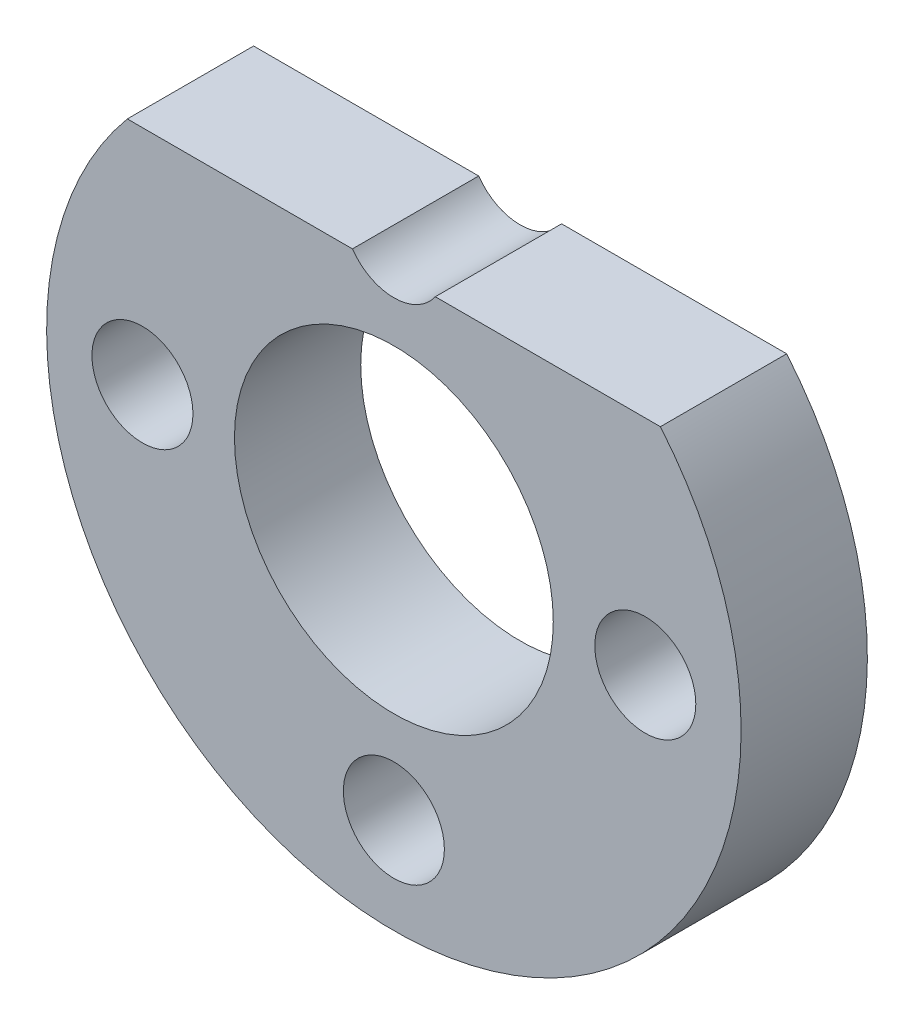
ISO-10303-21;
HEADER;
FILE_DESCRIPTION(('STEP AP214'),'2;1');
FILE_NAME('part.step','',(''),(''),'','','');
FILE_SCHEMA(('AUTOMOTIVE_DESIGN { 1 0 10303 214 1 1 1 1 }'));
ENDSEC;
DATA;
#1=APPLICATION_CONTEXT('core data for automotive mechanical design processes');
#2=APPLICATION_PROTOCOL_DEFINITION('international standard','automotive_design',2000,#1);
#3=PRODUCT_CONTEXT('',#1,'mechanical');
#4=PRODUCT('Part','Part','',(#3));
#5=PRODUCT_RELATED_PRODUCT_CATEGORY('part','',(#4));
#6=PRODUCT_DEFINITION_FORMATION('','',#4);
#7=PRODUCT_DEFINITION_CONTEXT('part definition',#1,'design');
#8=PRODUCT_DEFINITION('design','',#6,#7);
#9=PRODUCT_DEFINITION_SHAPE('','',#8);
#10=(LENGTH_UNIT() NAMED_UNIT(*) SI_UNIT(.MILLI.,.METRE.));
#11=(NAMED_UNIT(*) PLANE_ANGLE_UNIT() SI_UNIT($,.RADIAN.));
#12=(NAMED_UNIT(*) SI_UNIT($,.STERADIAN.) SOLID_ANGLE_UNIT());
#13=UNCERTAINTY_MEASURE_WITH_UNIT(LENGTH_MEASURE(1.E-05),#10,'distance_accuracy_value','');
#14=(GEOMETRIC_REPRESENTATION_CONTEXT(3) GLOBAL_UNCERTAINTY_ASSIGNED_CONTEXT((#13)) GLOBAL_UNIT_ASSIGNED_CONTEXT((#10,
#11,#12)) REPRESENTATION_CONTEXT('',''));
#15=CARTESIAN_POINT('',(0.,0.,0.));
#16=DIRECTION('',(0.,0.,1.));
#17=DIRECTION('',(1.,0.,0.));
#18=AXIS2_PLACEMENT_3D('',#15,#16,#17);
#19=CARTESIAN_POINT('',(95.2028085271053,-295.7159331995,4.));
#20=DIRECTION('',(0.,-1.,0.));
#21=DIRECTION('',(0.,0.,-1.));
#22=AXIS2_PLACEMENT_3D('',#19,#20,#21);
#23=PLANE('',#22);
#24=DIRECTION('',(-1.,0.,0.));
#25=VECTOR('',#24,1.);
#26=CARTESIAN_POINT('',(95.2028085271053,-295.7159331995,0.));
#27=LINE('',#26,#25);
#28=CARTESIAN_POINT('',(112.090377920005,-295.7159331995,0.));
#29=VERTEX_POINT('',#28);
#30=CARTESIAN_POINT('',(104.95933145547,-295.7159331995,0.));
#31=VERTEX_POINT('',#30);
#32=EDGE_CURVE('E77',#29,#31,#27,.T.);
#33=ORIENTED_EDGE('',*,*,#32,.T.);
#34=DIRECTION('',(0.,0.,1.));
#35=VECTOR('',#34,1.);
#36=CARTESIAN_POINT('',(104.95933145547,-295.7159331995,4.));
#37=LINE('',#36,#35);
#38=CARTESIAN_POINT('',(104.95933145547,-295.7159331995,4.));
#39=VERTEX_POINT('',#38);
#40=EDGE_CURVE('E11',#31,#39,#37,.T.);
#41=ORIENTED_EDGE('',*,*,#40,.T.);
#42=DIRECTION('',(-1.,0.,0.));
#43=VECTOR('',#42,1.);
#44=CARTESIAN_POINT('',(95.2028085271053,-295.7159331995,4.));
#45=LINE('',#44,#43);
#46=CARTESIAN_POINT('',(112.090377920005,-295.7159331995,4.));
#47=VERTEX_POINT('',#46);
#48=EDGE_CURVE('E85',#47,#39,#45,.T.);
#49=ORIENTED_EDGE('',*,*,#48,.F.);
#50=DIRECTION('',(0.,0.,-1.));
#51=VECTOR('',#50,1.);
#52=CARTESIAN_POINT('',(112.090377920005,-295.7159331995,4.));
#53=LINE('',#52,#51);
#54=EDGE_CURVE('E84',#47,#29,#53,.T.);
#55=ORIENTED_EDGE('',*,*,#54,.T.);
#56=EDGE_LOOP('',(#33,#41,#49,#55));
#57=FACE_BOUND('',#56,.T.);
#58=ADVANCED_FACE('F32',(#57),#23,.F.);
#59=CARTESIAN_POINT('',(103.646593223555,-302.7659331995,4.));
#60=DIRECTION('',(0.,0.,-1.));
#61=DIRECTION('',(-1.,0.,0.));
#62=AXIS2_PLACEMENT_3D('',#59,#60,#61);
#63=CYLINDRICAL_SURFACE('',#62,11.);
#64=CARTESIAN_POINT('',(103.646593223555,-302.7659331995,0.));
#65=DIRECTION('',(0.,0.,1.));
#66=DIRECTION('',(1.,0.,0.));
#67=AXIS2_PLACEMENT_3D('',#64,#65,#66);
#68=CIRCLE('',#67,11.);
#69=CARTESIAN_POINT('',(95.2028085271053,-295.7159331995,0.));
#70=VERTEX_POINT('',#69);
#71=EDGE_CURVE('E78',#70,#29,#68,.T.);
#72=ORIENTED_EDGE('',*,*,#71,.T.);
#73=ORIENTED_EDGE('',*,*,#54,.F.);
#74=CARTESIAN_POINT('',(103.646593223555,-302.7659331995,4.));
#75=DIRECTION('',(0.,0.,1.));
#76=DIRECTION('',(1.,0.,0.));
#77=AXIS2_PLACEMENT_3D('',#74,#75,#76);
#78=CIRCLE('',#77,11.);
#79=CARTESIAN_POINT('',(95.2028085271053,-295.7159331995,4.));
#80=VERTEX_POINT('',#79);
#81=EDGE_CURVE('E83',#80,#47,#78,.T.);
#82=ORIENTED_EDGE('',*,*,#81,.F.);
#83=DIRECTION('',(0.,0.,-1.));
#84=VECTOR('',#83,1.);
#85=CARTESIAN_POINT('',(95.2028085271053,-295.7159331995,4.));
#86=LINE('',#85,#84);
#87=EDGE_CURVE('E71',#80,#70,#86,.T.);
#88=ORIENTED_EDGE('',*,*,#87,.T.);
#89=EDGE_LOOP('',(#72,#73,#82,#88));
#90=FACE_BOUND('',#89,.T.);
#91=ADVANCED_FACE('F34',(#90),#63,.T.);
#92=CARTESIAN_POINT('',(102.333854991646,-295.7159331995,4.));
#93=VERTEX_POINT('',#92);
#94=EDGE_CURVE('E54',#93,#80,#45,.T.);
#95=ORIENTED_EDGE('',*,*,#94,.F.);
#96=DIRECTION('',(0.,0.,1.));
#97=VECTOR('',#96,1.);
#98=CARTESIAN_POINT('',(102.333854991646,-295.7159331995,4.));
#99=LINE('',#98,#97);
#100=CARTESIAN_POINT('',(102.333854991646,-295.7159331995,0.));
#101=VERTEX_POINT('',#100);
#102=EDGE_CURVE('E40',#93,#101,#99,.F.);
#103=ORIENTED_EDGE('',*,*,#102,.T.);
#104=EDGE_CURVE('E68',#101,#70,#27,.T.);
#105=ORIENTED_EDGE('',*,*,#104,.T.);
#106=ORIENTED_EDGE('',*,*,#87,.F.);
#107=EDGE_LOOP('',(#95,#103,#105,#106));
#108=FACE_BOUND('',#107,.T.);
#109=ADVANCED_FACE('F70',(#108),#23,.F.);
#110=CARTESIAN_POINT('',(103.646593223555,-302.7659331995,4.));
#111=DIRECTION('',(0.,0.,1.));
#112=DIRECTION('',(1.,0.,0.));
#113=AXIS2_PLACEMENT_3D('',#110,#111,#112);
#114=PLANE('',#113);
#115=CARTESIAN_POINT('',(95.6818701318656,-302.765933199499,4.));
#116=DIRECTION('',(0.,0.,1.));
#117=DIRECTION('',(1.,0.,0.));
#118=AXIS2_PLACEMENT_3D('',#115,#116,#117);
#119=CIRCLE('',#118,1.59999999999999);
#120=CARTESIAN_POINT('',(97.2818701318656,-302.765933199499,4.));
#121=VERTEX_POINT('',#120);
#122=EDGE_CURVE('E124',#121,#121,#119,.T.);
#123=ORIENTED_EDGE('',*,*,#122,.F.);
#124=EDGE_LOOP('',(#123));
#125=FACE_BOUND('',#124,.T.);
#126=CARTESIAN_POINT('',(111.61131631525,-302.765933199499,4.));
#127=DIRECTION('',(0.,0.,1.));
#128=DIRECTION('',(1.,0.,0.));
#129=AXIS2_PLACEMENT_3D('',#126,#127,#128);
#130=CIRCLE('',#129,1.59999999999999);
#131=CARTESIAN_POINT('',(113.21131631525,-302.765933199499,4.));
#132=VERTEX_POINT('',#131);
#133=EDGE_CURVE('E118',#132,#132,#130,.T.);
#134=ORIENTED_EDGE('',*,*,#133,.F.);
#135=EDGE_LOOP('',(#134));
#136=FACE_BOUND('',#135,.T.);
#137=CARTESIAN_POINT('',(103.646593223558,-310.730656291191,4.));
#138=DIRECTION('',(0.,0.,1.));
#139=DIRECTION('',(1.,0.,0.));
#140=AXIS2_PLACEMENT_3D('',#137,#138,#139);
#141=CIRCLE('',#140,1.59999999999999);
#142=CARTESIAN_POINT('',(105.246593223558,-310.730656291191,4.));
#143=VERTEX_POINT('',#142);
#144=EDGE_CURVE('E112',#143,#143,#141,.T.);
#145=ORIENTED_EDGE('',*,*,#144,.F.);
#146=EDGE_LOOP('',(#145));
#147=FACE_BOUND('',#146,.T.);
#148=CARTESIAN_POINT('',(103.646593223558,-294.801210107807,4.));
#149=DIRECTION('',(0.,0.,1.));
#150=DIRECTION('',(1.,0.,0.));
#151=AXIS2_PLACEMENT_3D('',#148,#149,#150);
#152=CIRCLE('',#151,1.59999999999999);
#153=EDGE_CURVE('E107',#93,#39,#152,.T.);
#154=ORIENTED_EDGE('',*,*,#153,.F.);
#155=ORIENTED_EDGE('',*,*,#94,.T.);
#156=ORIENTED_EDGE('',*,*,#81,.T.);
#157=ORIENTED_EDGE('',*,*,#48,.T.);
#158=EDGE_LOOP('',(#154,#155,#156,#157));
#159=FACE_BOUND('',#158,.T.);
#160=CARTESIAN_POINT('',(103.646593223555,-302.7659331995,4.));
#161=DIRECTION('',(0.,0.,1.));
#162=DIRECTION('',(1.,0.,0.));
#163=AXIS2_PLACEMENT_3D('',#160,#161,#162);
#164=CIRCLE('',#163,5.05000000000002);
#165=CARTESIAN_POINT('',(108.696593223555,-302.7659331995,4.));
#166=VERTEX_POINT('',#165);
#167=EDGE_CURVE('E93',#166,#166,#164,.T.);
#168=ORIENTED_EDGE('',*,*,#167,.F.);
#169=EDGE_LOOP('',(#168));
#170=FACE_BOUND('',#169,.T.);
#171=ADVANCED_FACE('F100',(#125,#136,#147,#159,#170),#114,.T.);
#172=CARTESIAN_POINT('',(103.646593223555,-302.7659331995,0.));
#173=DIRECTION('',(0.,0.,1.));
#174=DIRECTION('',(1.,0.,0.));
#175=AXIS2_PLACEMENT_3D('',#172,#173,#174);
#176=PLANE('',#175);
#177=CARTESIAN_POINT('',(95.6818701318656,-302.765933199499,0.));
#178=DIRECTION('',(0.,0.,1.));
#179=DIRECTION('',(1.,0.,0.));
#180=AXIS2_PLACEMENT_3D('',#177,#178,#179);
#181=CIRCLE('',#180,1.6);
#182=CARTESIAN_POINT('',(97.2818701318656,-302.765933199499,0.));
#183=VERTEX_POINT('',#182);
#184=EDGE_CURVE('E121',#183,#183,#181,.T.);
#185=ORIENTED_EDGE('',*,*,#184,.T.);
#186=EDGE_LOOP('',(#185));
#187=FACE_BOUND('',#186,.T.);
#188=CARTESIAN_POINT('',(111.61131631525,-302.765933199499,0.));
#189=DIRECTION('',(0.,0.,1.));
#190=DIRECTION('',(1.,0.,0.));
#191=AXIS2_PLACEMENT_3D('',#188,#189,#190);
#192=CIRCLE('',#191,1.6);
#193=CARTESIAN_POINT('',(113.21131631525,-302.765933199499,0.));
#194=VERTEX_POINT('',#193);
#195=EDGE_CURVE('E115',#194,#194,#192,.T.);
#196=ORIENTED_EDGE('',*,*,#195,.T.);
#197=EDGE_LOOP('',(#196));
#198=FACE_BOUND('',#197,.T.);
#199=CARTESIAN_POINT('',(103.646593223558,-310.730656291191,0.));
#200=DIRECTION('',(0.,0.,1.));
#201=DIRECTION('',(1.,0.,0.));
#202=AXIS2_PLACEMENT_3D('',#199,#200,#201);
#203=CIRCLE('',#202,1.6);
#204=CARTESIAN_POINT('',(105.246593223558,-310.730656291191,0.));
#205=VERTEX_POINT('',#204);
#206=EDGE_CURVE('E109',#205,#205,#203,.T.);
#207=ORIENTED_EDGE('',*,*,#206,.T.);
#208=EDGE_LOOP('',(#207));
#209=FACE_BOUND('',#208,.T.);
#210=CARTESIAN_POINT('',(103.646593223555,-302.7659331995,0.));
#211=DIRECTION('',(0.,0.,1.));
#212=DIRECTION('',(1.,0.,0.));
#213=AXIS2_PLACEMENT_3D('',#210,#211,#212);
#214=CIRCLE('',#213,5.05000000000002);
#215=CARTESIAN_POINT('',(108.696593223555,-302.7659331995,0.));
#216=VERTEX_POINT('',#215);
#217=EDGE_CURVE('E90',#216,#216,#214,.T.);
#218=ORIENTED_EDGE('',*,*,#217,.T.);
#219=EDGE_LOOP('',(#218));
#220=FACE_BOUND('',#219,.T.);
#221=ORIENTED_EDGE('',*,*,#104,.F.);
#222=CARTESIAN_POINT('',(103.646593223558,-294.801210107807,0.));
#223=DIRECTION('',(0.,0.,1.));
#224=DIRECTION('',(1.,0.,0.));
#225=AXIS2_PLACEMENT_3D('',#222,#223,#224);
#226=CIRCLE('',#225,1.6);
#227=EDGE_CURVE('E104',#101,#31,#226,.T.);
#228=ORIENTED_EDGE('',*,*,#227,.T.);
#229=ORIENTED_EDGE('',*,*,#32,.F.);
#230=ORIENTED_EDGE('',*,*,#71,.F.);
#231=EDGE_LOOP('',(#221,#228,#229,#230));
#232=FACE_BOUND('',#231,.T.);
#233=ADVANCED_FACE('F87',(#187,#198,#209,#220,#232),#176,.F.);
#234=CARTESIAN_POINT('',(103.646593223555,-302.7659331995,0.));
#235=DIRECTION('',(0.,0.,1.));
#236=DIRECTION('',(1.,0.,0.));
#237=AXIS2_PLACEMENT_3D('',#234,#235,#236);
#238=CYLINDRICAL_SURFACE('',#237,5.05000000000002);
#239=ORIENTED_EDGE('',*,*,#217,.F.);
#240=EDGE_LOOP('',(#239));
#241=FACE_BOUND('',#240,.T.);
#242=ORIENTED_EDGE('',*,*,#167,.T.);
#243=EDGE_LOOP('',(#242));
#244=FACE_BOUND('',#243,.T.);
#245=ADVANCED_FACE('F149',(#241,#244),#238,.F.);
#246=CARTESIAN_POINT('',(103.646593223558,-294.801210107807,4.));
#247=DIRECTION('',(0.,0.,1.));
#248=DIRECTION('',(1.,0.,0.));
#249=AXIS2_PLACEMENT_3D('',#246,#247,#248);
#250=CYLINDRICAL_SURFACE('',#249,1.6);
#251=ORIENTED_EDGE('',*,*,#227,.F.);
#252=ORIENTED_EDGE('',*,*,#102,.F.);
#253=ORIENTED_EDGE('',*,*,#153,.T.);
#254=ORIENTED_EDGE('',*,*,#40,.F.);
#255=EDGE_LOOP('',(#251,#252,#253,#254));
#256=FACE_BOUND('',#255,.T.);
#257=ADVANCED_FACE('F140',(#256),#250,.F.);
#258=CARTESIAN_POINT('',(103.646593223558,-310.730656291191,4.));
#259=DIRECTION('',(0.,0.,1.));
#260=DIRECTION('',(1.,0.,0.));
#261=AXIS2_PLACEMENT_3D('',#258,#259,#260);
#262=CYLINDRICAL_SURFACE('',#261,1.6);
#263=ORIENTED_EDGE('',*,*,#206,.F.);
#264=EDGE_LOOP('',(#263));
#265=FACE_BOUND('',#264,.T.);
#266=ORIENTED_EDGE('',*,*,#144,.T.);
#267=EDGE_LOOP('',(#266));
#268=FACE_BOUND('',#267,.T.);
#269=ADVANCED_FACE('F137',(#265,#268),#262,.F.);
#270=CARTESIAN_POINT('',(111.61131631525,-302.765933199499,4.));
#271=DIRECTION('',(0.,0.,1.));
#272=DIRECTION('',(1.,0.,0.));
#273=AXIS2_PLACEMENT_3D('',#270,#271,#272);
#274=CYLINDRICAL_SURFACE('',#273,1.6);
#275=ORIENTED_EDGE('',*,*,#195,.F.);
#276=EDGE_LOOP('',(#275));
#277=FACE_BOUND('',#276,.T.);
#278=ORIENTED_EDGE('',*,*,#133,.T.);
#279=EDGE_LOOP('',(#278));
#280=FACE_BOUND('',#279,.T.);
#281=ADVANCED_FACE('F139',(#277,#280),#274,.F.);
#282=CARTESIAN_POINT('',(95.6818701318656,-302.765933199499,4.));
#283=DIRECTION('',(0.,0.,1.));
#284=DIRECTION('',(1.,0.,0.));
#285=AXIS2_PLACEMENT_3D('',#282,#283,#284);
#286=CYLINDRICAL_SURFACE('',#285,1.6);
#287=ORIENTED_EDGE('',*,*,#184,.F.);
#288=EDGE_LOOP('',(#287));
#289=FACE_BOUND('',#288,.T.);
#290=ORIENTED_EDGE('',*,*,#122,.T.);
#291=EDGE_LOOP('',(#290));
#292=FACE_BOUND('',#291,.T.);
#293=ADVANCED_FACE('F128',(#289,#292),#286,.F.);
#294=CLOSED_SHELL('',(#58,#91,#109,#171,#233,#245,#257,#269,#281,#293));
#295=MANIFOLD_SOLID_BREP('B2',#294);
#296=ADVANCED_BREP_SHAPE_REPRESENTATION('',(#18,#295),#14);
#297=SHAPE_DEFINITION_REPRESENTATION(#9,#296);
ENDSEC;
END-ISO-10303-21;
